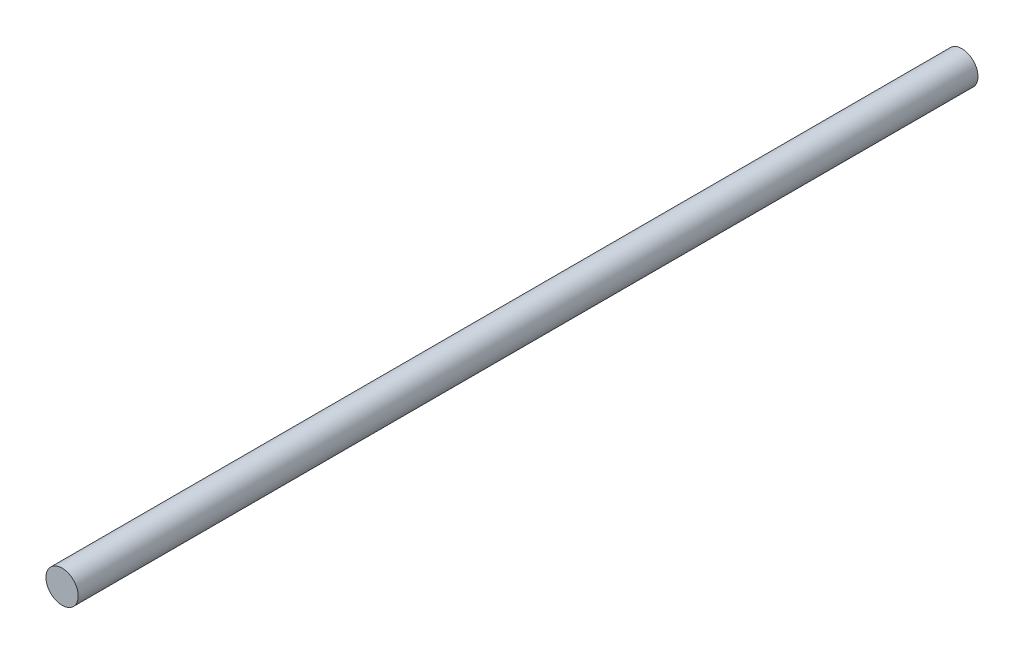
ISO-10303-21;
HEADER;
FILE_DESCRIPTION(('STEP AP214'),'2;1');
FILE_NAME('part.step','',(''),(''),'','','');
FILE_SCHEMA(('AUTOMOTIVE_DESIGN { 1 0 10303 214 1 1 1 1 }'));
ENDSEC;
DATA;
#1=APPLICATION_CONTEXT('core data for automotive mechanical design processes');
#2=APPLICATION_PROTOCOL_DEFINITION('international standard','automotive_design',2000,#1);
#3=PRODUCT_CONTEXT('',#1,'mechanical');
#4=PRODUCT('Part','Part','',(#3));
#5=PRODUCT_RELATED_PRODUCT_CATEGORY('part','',(#4));
#6=PRODUCT_DEFINITION_FORMATION('','',#4);
#7=PRODUCT_DEFINITION_CONTEXT('part definition',#1,'design');
#8=PRODUCT_DEFINITION('design','',#6,#7);
#9=PRODUCT_DEFINITION_SHAPE('','',#8);
#10=(LENGTH_UNIT() NAMED_UNIT(*) SI_UNIT(.MILLI.,.METRE.));
#11=(NAMED_UNIT(*) PLANE_ANGLE_UNIT() SI_UNIT($,.RADIAN.));
#12=(NAMED_UNIT(*) SI_UNIT($,.STERADIAN.) SOLID_ANGLE_UNIT());
#13=UNCERTAINTY_MEASURE_WITH_UNIT(LENGTH_MEASURE(1.E-05),#10,'distance_accuracy_value','');
#14=(GEOMETRIC_REPRESENTATION_CONTEXT(3) GLOBAL_UNCERTAINTY_ASSIGNED_CONTEXT((#13)) GLOBAL_UNIT_ASSIGNED_CONTEXT((#10,
#11,#12)) REPRESENTATION_CONTEXT('',''));
#15=CARTESIAN_POINT('',(0.,0.,0.));
#16=DIRECTION('',(0.,0.,1.));
#17=DIRECTION('',(1.,0.,0.));
#18=AXIS2_PLACEMENT_3D('',#15,#16,#17);
#19=CARTESIAN_POINT('',(0.,0.,223.3));
#20=DIRECTION('',(0.,0.,-1.));
#21=DIRECTION('',(-1.,0.,0.));
#22=AXIS2_PLACEMENT_3D('',#19,#20,#21);
#23=CYLINDRICAL_SURFACE('',#22,4.);
#24=CARTESIAN_POINT('',(0.,0.,223.3));
#25=DIRECTION('',(0.,0.,1.));
#26=DIRECTION('',(1.,0.,0.));
#27=AXIS2_PLACEMENT_3D('',#24,#25,#26);
#28=CIRCLE('',#27,4.);
#29=CARTESIAN_POINT('',(4.,0.,223.3));
#30=VERTEX_POINT('',#29);
#31=EDGE_CURVE('E10',#30,#30,#28,.T.);
#32=ORIENTED_EDGE('',*,*,#31,.F.);
#33=EDGE_LOOP('',(#32));
#34=FACE_BOUND('',#33,.T.);
#35=CARTESIAN_POINT('',(0.,0.,0.));
#36=DIRECTION('',(0.,0.,1.));
#37=DIRECTION('',(1.,0.,0.));
#38=AXIS2_PLACEMENT_3D('',#35,#36,#37);
#39=CIRCLE('',#38,4.);
#40=CARTESIAN_POINT('',(4.,0.,0.));
#41=VERTEX_POINT('',#40);
#42=EDGE_CURVE('E34',#41,#41,#39,.T.);
#43=ORIENTED_EDGE('',*,*,#42,.T.);
#44=EDGE_LOOP('',(#43));
#45=FACE_BOUND('',#44,.T.);
#46=ADVANCED_FACE('F31',(#34,#45),#23,.T.);
#47=CARTESIAN_POINT('',(0.,0.,223.3));
#48=DIRECTION('',(0.,0.,1.));
#49=DIRECTION('',(1.,0.,0.));
#50=AXIS2_PLACEMENT_3D('',#47,#48,#49);
#51=PLANE('',#50);
#52=ORIENTED_EDGE('',*,*,#31,.T.);
#53=EDGE_LOOP('',(#52));
#54=FACE_BOUND('',#53,.T.);
#55=ADVANCED_FACE('F46',(#54),#51,.T.);
#56=CARTESIAN_POINT('',(0.,0.,0.));
#57=DIRECTION('',(0.,0.,1.));
#58=DIRECTION('',(1.,0.,0.));
#59=AXIS2_PLACEMENT_3D('',#56,#57,#58);
#60=PLANE('',#59);
#61=ORIENTED_EDGE('',*,*,#42,.F.);
#62=EDGE_LOOP('',(#61));
#63=FACE_BOUND('',#62,.T.);
#64=ADVANCED_FACE('F44',(#63),#60,.F.);
#65=CLOSED_SHELL('',(#46,#55,#64));
#66=MANIFOLD_SOLID_BREP('B2',#65);
#67=ADVANCED_BREP_SHAPE_REPRESENTATION('',(#18,#66),#14);
#68=SHAPE_DEFINITION_REPRESENTATION(#9,#67);
ENDSEC;
END-ISO-10303-21;
